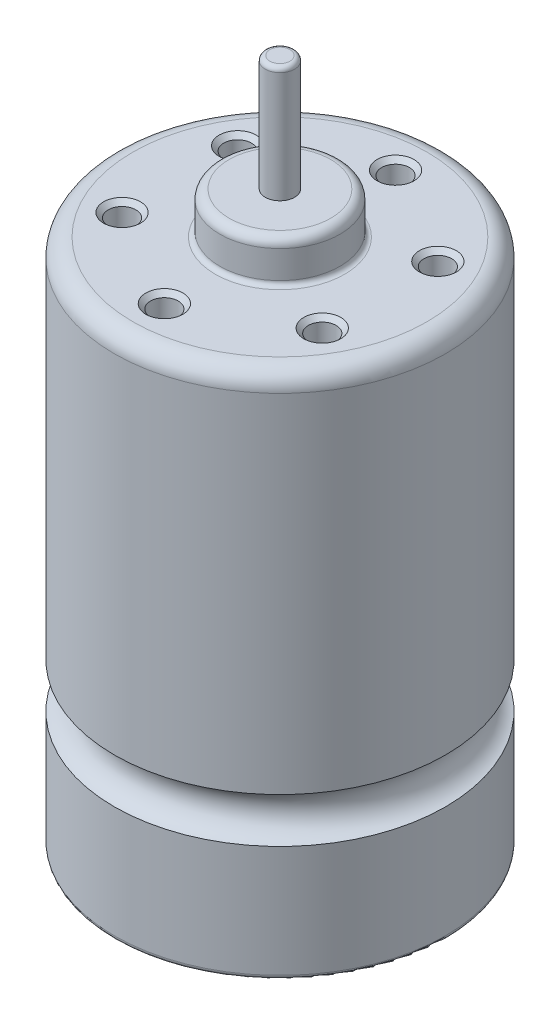
ISO-10303-21;
HEADER;
FILE_DESCRIPTION(('STEP AP214'),'2;1');
FILE_NAME('part.step','',(''),(''),'','','');
FILE_SCHEMA(('AUTOMOTIVE_DESIGN { 1 0 10303 214 1 1 1 1 }'));
ENDSEC;
DATA;
#1=APPLICATION_CONTEXT('core data for automotive mechanical design processes');
#2=APPLICATION_PROTOCOL_DEFINITION('international standard','automotive_design',2000,#1);
#3=PRODUCT_CONTEXT('',#1,'mechanical');
#4=PRODUCT('Part','Part','',(#3));
#5=PRODUCT_RELATED_PRODUCT_CATEGORY('part','',(#4));
#6=PRODUCT_DEFINITION_FORMATION('','',#4);
#7=PRODUCT_DEFINITION_CONTEXT('part definition',#1,'design');
#8=PRODUCT_DEFINITION('design','',#6,#7);
#9=PRODUCT_DEFINITION_SHAPE('','',#8);
#10=(LENGTH_UNIT() NAMED_UNIT(*) SI_UNIT(.MILLI.,.METRE.));
#11=(NAMED_UNIT(*) PLANE_ANGLE_UNIT() SI_UNIT($,.RADIAN.));
#12=(NAMED_UNIT(*) SI_UNIT($,.STERADIAN.) SOLID_ANGLE_UNIT());
#13=UNCERTAINTY_MEASURE_WITH_UNIT(LENGTH_MEASURE(1.E-05),#10,'distance_accuracy_value','');
#14=(GEOMETRIC_REPRESENTATION_CONTEXT(3) GLOBAL_UNCERTAINTY_ASSIGNED_CONTEXT((#13)) GLOBAL_UNIT_ASSIGNED_CONTEXT((#10,
#11,#12)) REPRESENTATION_CONTEXT('',''));
#15=CARTESIAN_POINT('',(0.,0.,0.));
#16=DIRECTION('',(0.,0.,1.));
#17=DIRECTION('',(1.,0.,0.));
#18=AXIS2_PLACEMENT_3D('',#15,#16,#17);
#19=CARTESIAN_POINT('',(0.,57.,0.));
#20=DIRECTION('',(0.,-1.,0.));
#21=DIRECTION('',(0.,0.,-1.));
#22=AXIS2_PLACEMENT_3D('',#19,#20,#21);
#23=CYLINDRICAL_SURFACE('',#22,17.9);
#24=CARTESIAN_POINT('',(0.,55.,0.));
#25=DIRECTION('',(0.,1.,0.));
#26=DIRECTION('',(0.,0.,1.));
#27=AXIS2_PLACEMENT_3D('',#24,#25,#26);
#28=CIRCLE('',#27,17.9);
#29=CARTESIAN_POINT('',(0.,55.,17.9));
#30=VERTEX_POINT('',#29);
#31=EDGE_CURVE('E67',#30,#30,#28,.F.);
#32=ORIENTED_EDGE('',*,*,#31,.T.);
#33=EDGE_LOOP('',(#32));
#34=FACE_BOUND('',#33,.T.);
#35=CARTESIAN_POINT('',(0.,17.4269322199023,0.));
#36=DIRECTION('',(0.,-1.,0.));
#37=DIRECTION('',(0.,0.,-1.));
#38=AXIS2_PLACEMENT_3D('',#35,#36,#37);
#39=CIRCLE('',#38,17.9);
#40=CARTESIAN_POINT('',(0.,17.4269322199023,-17.9));
#41=VERTEX_POINT('',#40);
#42=EDGE_CURVE('E122',#41,#41,#39,.F.);
#43=ORIENTED_EDGE('',*,*,#42,.T.);
#44=EDGE_LOOP('',(#43));
#45=FACE_BOUND('',#44,.T.);
#46=ADVANCED_FACE('F35',(#34,#45),#23,.T.);
#47=CARTESIAN_POINT('',(0.,57.,0.));
#48=DIRECTION('',(0.,1.,0.));
#49=DIRECTION('',(0.,0.,1.));
#50=AXIS2_PLACEMENT_3D('',#47,#48,#49);
#51=PLANE('',#50);
#52=CARTESIAN_POINT('',(0.,57.,0.));
#53=DIRECTION('',(0.,1.,0.));
#54=DIRECTION('',(0.,0.,1.));
#55=AXIS2_PLACEMENT_3D('',#52,#53,#54);
#56=CIRCLE('',#55,7.);
#57=CARTESIAN_POINT('',(0.,57.,7.));
#58=VERTEX_POINT('',#57);
#59=EDGE_CURVE('E42',#58,#58,#56,.F.);
#60=ORIENTED_EDGE('',*,*,#59,.T.);
#61=EDGE_LOOP('',(#60));
#62=FACE_BOUND('',#61,.T.);
#63=CARTESIAN_POINT('',(0.,57.,0.));
#64=DIRECTION('',(0.,1.,0.));
#65=DIRECTION('',(0.,0.,1.));
#66=AXIS2_PLACEMENT_3D('',#63,#64,#65);
#67=CIRCLE('',#66,15.9);
#68=CARTESIAN_POINT('',(0.,57.,15.9));
#69=VERTEX_POINT('',#68);
#70=EDGE_CURVE('E70',#69,#69,#67,.T.);
#71=ORIENTED_EDGE('',*,*,#70,.T.);
#72=EDGE_LOOP('',(#71));
#73=FACE_BOUND('',#72,.T.);
#74=CARTESIAN_POINT('',(10.8253175473055,57.,-6.25000000000001));
#75=DIRECTION('',(0.,1.,0.));
#76=DIRECTION('',(0.,0.,1.));
#77=AXIS2_PLACEMENT_3D('',#74,#75,#76);
#78=CIRCLE('',#77,1.99999999999999);
#79=CARTESIAN_POINT('',(10.8253175473055,57.,-4.25000000000002));
#80=VERTEX_POINT('',#79);
#81=EDGE_CURVE('E100',#80,#80,#78,.F.);
#82=ORIENTED_EDGE('',*,*,#81,.T.);
#83=EDGE_LOOP('',(#82));
#84=FACE_BOUND('',#83,.T.);
#85=CARTESIAN_POINT('',(10.8253175473055,57.,6.24999999999999));
#86=DIRECTION('',(0.,1.,0.));
#87=DIRECTION('',(0.,0.,1.));
#88=AXIS2_PLACEMENT_3D('',#85,#86,#87);
#89=CIRCLE('',#88,1.99999999999999);
#90=CARTESIAN_POINT('',(10.8253175473055,57.,8.24999999999998));
#91=VERTEX_POINT('',#90);
#92=EDGE_CURVE('E103',#91,#91,#89,.F.);
#93=ORIENTED_EDGE('',*,*,#92,.T.);
#94=EDGE_LOOP('',(#93));
#95=FACE_BOUND('',#94,.T.);
#96=CARTESIAN_POINT('',(0.,57.,12.5));
#97=DIRECTION('',(0.,1.,0.));
#98=DIRECTION('',(0.,0.,1.));
#99=AXIS2_PLACEMENT_3D('',#96,#97,#98);
#100=CIRCLE('',#99,1.99999999999999);
#101=CARTESIAN_POINT('',(0.,57.,14.5));
#102=VERTEX_POINT('',#101);
#103=EDGE_CURVE('E106',#102,#102,#100,.F.);
#104=ORIENTED_EDGE('',*,*,#103,.T.);
#105=EDGE_LOOP('',(#104));
#106=FACE_BOUND('',#105,.T.);
#107=CARTESIAN_POINT('',(-10.8253175473055,57.,6.25000000000001));
#108=DIRECTION('',(0.,1.,0.));
#109=DIRECTION('',(0.,0.,1.));
#110=AXIS2_PLACEMENT_3D('',#107,#108,#109);
#111=CIRCLE('',#110,1.99999999999997);
#112=CARTESIAN_POINT('',(-10.8253175473055,57.,8.24999999999998));
#113=VERTEX_POINT('',#112);
#114=EDGE_CURVE('E109',#113,#113,#111,.F.);
#115=ORIENTED_EDGE('',*,*,#114,.T.);
#116=EDGE_LOOP('',(#115));
#117=FACE_BOUND('',#116,.T.);
#118=CARTESIAN_POINT('',(-10.8253175473055,57.,-6.25));
#119=DIRECTION('',(0.,1.,0.));
#120=DIRECTION('',(0.,0.,1.));
#121=AXIS2_PLACEMENT_3D('',#118,#119,#120);
#122=CIRCLE('',#121,1.99999999999999);
#123=CARTESIAN_POINT('',(-10.8253175473055,57.,-4.25000000000001));
#124=VERTEX_POINT('',#123);
#125=EDGE_CURVE('E112',#124,#124,#122,.F.);
#126=ORIENTED_EDGE('',*,*,#125,.T.);
#127=EDGE_LOOP('',(#126));
#128=FACE_BOUND('',#127,.T.);
#129=CARTESIAN_POINT('',(0.,57.,-12.5));
#130=DIRECTION('',(0.,1.,0.));
#131=DIRECTION('',(0.,0.,1.));
#132=AXIS2_PLACEMENT_3D('',#129,#130,#131);
#133=CIRCLE('',#132,1.99999999999999);
#134=CARTESIAN_POINT('',(0.,57.,-10.5));
#135=VERTEX_POINT('',#134);
#136=EDGE_CURVE('E115',#135,#135,#133,.F.);
#137=ORIENTED_EDGE('',*,*,#136,.T.);
#138=EDGE_LOOP('',(#137));
#139=FACE_BOUND('',#138,.T.);
#140=ADVANCED_FACE('F172',(#62,#73,#84,#95,#106,#117,#128,#139),#51,.T.);
#141=CARTESIAN_POINT('',(0.,61.5,0.));
#142=DIRECTION('',(0.,-1.,0.));
#143=DIRECTION('',(0.,0.,-1.));
#144=AXIS2_PLACEMENT_3D('',#141,#142,#143);
#145=CYLINDRICAL_SURFACE('',#144,6.5);
#146=CARTESIAN_POINT('',(0.,57.5,0.));
#147=DIRECTION('',(0.,1.,0.));
#148=DIRECTION('',(0.,0.,1.));
#149=AXIS2_PLACEMENT_3D('',#146,#147,#148);
#150=CIRCLE('',#149,6.5);
#151=CARTESIAN_POINT('',(0.,57.5,6.5));
#152=VERTEX_POINT('',#151);
#153=EDGE_CURVE('E46',#152,#152,#150,.T.);
#154=ORIENTED_EDGE('',*,*,#153,.T.);
#155=EDGE_LOOP('',(#154));
#156=FACE_BOUND('',#155,.T.);
#157=CARTESIAN_POINT('',(0.,60.5,0.));
#158=DIRECTION('',(0.,1.,0.));
#159=DIRECTION('',(0.,0.,1.));
#160=AXIS2_PLACEMENT_3D('',#157,#158,#159);
#161=CIRCLE('',#160,6.5);
#162=CARTESIAN_POINT('',(0.,60.5,6.5));
#163=VERTEX_POINT('',#162);
#164=EDGE_CURVE('E73',#163,#163,#161,.F.);
#165=ORIENTED_EDGE('',*,*,#164,.T.);
#166=EDGE_LOOP('',(#165));
#167=FACE_BOUND('',#166,.T.);
#168=ADVANCED_FACE('F179',(#156,#167),#145,.T.);
#169=CARTESIAN_POINT('',(0.,61.5,0.));
#170=DIRECTION('',(0.,1.,0.));
#171=DIRECTION('',(0.,0.,1.));
#172=AXIS2_PLACEMENT_3D('',#169,#170,#171);
#173=PLANE('',#172);
#174=CARTESIAN_POINT('',(0.,61.5,0.));
#175=DIRECTION('',(0.,1.,0.));
#176=DIRECTION('',(0.,0.,1.));
#177=AXIS2_PLACEMENT_3D('',#174,#175,#176);
#178=CIRCLE('',#177,5.5);
#179=CARTESIAN_POINT('',(0.,61.5,5.5));
#180=VERTEX_POINT('',#179);
#181=EDGE_CURVE('E76',#180,#180,#178,.T.);
#182=ORIENTED_EDGE('',*,*,#181,.T.);
#183=EDGE_LOOP('',(#182));
#184=FACE_BOUND('',#183,.T.);
#185=CARTESIAN_POINT('',(0.,61.5,0.));
#186=DIRECTION('',(0.,1.,0.));
#187=DIRECTION('',(0.,0.,1.));
#188=AXIS2_PLACEMENT_3D('',#185,#186,#187);
#189=CIRCLE('',#188,1.585);
#190=CARTESIAN_POINT('',(0.,61.5,1.585));
#191=VERTEX_POINT('',#190);
#192=EDGE_CURVE('E125',#191,#191,#189,.F.);
#193=ORIENTED_EDGE('',*,*,#192,.T.);
#194=EDGE_LOOP('',(#193));
#195=FACE_BOUND('',#194,.T.);
#196=ADVANCED_FACE('F214',(#184,#195),#173,.T.);
#197=CARTESIAN_POINT('',(0.,74.,0.));
#198=DIRECTION('',(0.,-1.,0.));
#199=DIRECTION('',(0.,0.,-1.));
#200=AXIS2_PLACEMENT_3D('',#197,#198,#199);
#201=CYLINDRICAL_SURFACE('',#200,1.585);
#202=CARTESIAN_POINT('',(0.,73.5,0.));
#203=DIRECTION('',(0.,1.,0.));
#204=DIRECTION('',(0.,0.,1.));
#205=AXIS2_PLACEMENT_3D('',#202,#203,#204);
#206=CIRCLE('',#205,1.585);
#207=CARTESIAN_POINT('',(0.,73.5,1.585));
#208=VERTEX_POINT('',#207);
#209=EDGE_CURVE('E61',#208,#208,#206,.F.);
#210=ORIENTED_EDGE('',*,*,#209,.T.);
#211=EDGE_LOOP('',(#210));
#212=FACE_BOUND('',#211,.T.);
#213=ORIENTED_EDGE('',*,*,#192,.F.);
#214=EDGE_LOOP('',(#213));
#215=FACE_BOUND('',#214,.T.);
#216=ADVANCED_FACE('F207',(#212,#215),#201,.T.);
#217=CARTESIAN_POINT('',(0.,74.,0.));
#218=DIRECTION('',(0.,1.,0.));
#219=DIRECTION('',(0.,0.,1.));
#220=AXIS2_PLACEMENT_3D('',#217,#218,#219);
#221=PLANE('',#220);
#222=CARTESIAN_POINT('',(0.,74.,0.));
#223=DIRECTION('',(0.,1.,0.));
#224=DIRECTION('',(0.,0.,1.));
#225=AXIS2_PLACEMENT_3D('',#222,#223,#224);
#226=CIRCLE('',#225,1.085);
#227=CARTESIAN_POINT('',(0.,74.,1.085));
#228=VERTEX_POINT('',#227);
#229=EDGE_CURVE('E64',#228,#228,#226,.T.);
#230=ORIENTED_EDGE('',*,*,#229,.T.);
#231=EDGE_LOOP('',(#230));
#232=FACE_BOUND('',#231,.T.);
#233=ADVANCED_FACE('F201',(#232),#221,.T.);
#234=CARTESIAN_POINT('',(0.,15.,0.));
#235=DIRECTION('',(0.,1.,0.));
#236=DIRECTION('',(0.,0.,1.));
#237=AXIS2_PLACEMENT_3D('',#234,#235,#236);
#238=TOROIDAL_SURFACE('',#237,18.5,2.5);
#239=CARTESIAN_POINT('',(0.,12.5730677800977,0.));
#240=DIRECTION('',(0.,1.,0.));
#241=DIRECTION('',(0.,0.,1.));
#242=AXIS2_PLACEMENT_3D('',#239,#240,#241);
#243=CIRCLE('',#242,17.9);
#244=CARTESIAN_POINT('',(0.,12.5730677800977,17.9));
#245=VERTEX_POINT('',#244);
#246=EDGE_CURVE('E126',#245,#245,#243,.F.);
#247=ORIENTED_EDGE('',*,*,#246,.F.);
#248=EDGE_LOOP('',(#247));
#249=FACE_BOUND('',#248,.T.);
#250=ORIENTED_EDGE('',*,*,#42,.F.);
#251=EDGE_LOOP('',(#250));
#252=FACE_BOUND('',#251,.T.);
#253=ADVANCED_FACE('F194',(#249,#252),#238,.F.);
#254=CARTESIAN_POINT('',(0.,0.,0.));
#255=DIRECTION('',(0.,1.,0.));
#256=DIRECTION('',(0.,0.,1.));
#257=AXIS2_PLACEMENT_3D('',#254,#255,#256);
#258=PLANE('',#257);
#259=CARTESIAN_POINT('',(0.,0.,0.));
#260=DIRECTION('',(0.,1.,0.));
#261=DIRECTION('',(0.,0.,1.));
#262=AXIS2_PLACEMENT_3D('',#259,#260,#261);
#263=CIRCLE('',#262,5.6);
#264=CARTESIAN_POINT('',(0.,0.,5.6));
#265=VERTEX_POINT('',#264);
#266=EDGE_CURVE('E50',#265,#265,#263,.T.);
#267=ORIENTED_EDGE('',*,*,#266,.T.);
#268=EDGE_LOOP('',(#267));
#269=FACE_BOUND('',#268,.T.);
#270=CARTESIAN_POINT('',(0.,0.,0.));
#271=DIRECTION('',(0.,1.,0.));
#272=DIRECTION('',(0.,0.,1.));
#273=AXIS2_PLACEMENT_3D('',#270,#271,#272);
#274=CIRCLE('',#273,17.4);
#275=CARTESIAN_POINT('',(0.,0.,17.4));
#276=VERTEX_POINT('',#275);
#277=EDGE_CURVE('E55',#276,#276,#274,.F.);
#278=ORIENTED_EDGE('',*,*,#277,.T.);
#279=EDGE_LOOP('',(#278));
#280=FACE_BOUND('',#279,.T.);
#281=ADVANCED_FACE('F186',(#269,#280),#258,.F.);
#282=CARTESIAN_POINT('',(0.,0.5,0.));
#283=DIRECTION('',(0.,1.,0.));
#284=DIRECTION('',(0.,0.,1.));
#285=AXIS2_PLACEMENT_3D('',#282,#283,#284);
#286=CIRCLE('',#285,17.9);
#287=CARTESIAN_POINT('',(0.,0.5,17.9));
#288=VERTEX_POINT('',#287);
#289=EDGE_CURVE('E10',#288,#288,#286,.T.);
#290=ORIENTED_EDGE('',*,*,#289,.T.);
#291=EDGE_LOOP('',(#290));
#292=FACE_BOUND('',#291,.T.);
#293=ORIENTED_EDGE('',*,*,#246,.T.);
#294=EDGE_LOOP('',(#293));
#295=FACE_BOUND('',#294,.T.);
#296=ADVANCED_FACE('F175',(#292,#295),#23,.T.);
#297=CARTESIAN_POINT('',(0.,-3.,0.));
#298=DIRECTION('',(0.,1.,0.));
#299=DIRECTION('',(0.,0.,1.));
#300=AXIS2_PLACEMENT_3D('',#297,#298,#299);
#301=CYLINDRICAL_SURFACE('',#300,5.1);
#302=CARTESIAN_POINT('',(0.,-0.5,0.));
#303=DIRECTION('',(0.,1.,0.));
#304=DIRECTION('',(0.,0.,1.));
#305=AXIS2_PLACEMENT_3D('',#302,#303,#304);
#306=CIRCLE('',#305,5.1);
#307=CARTESIAN_POINT('',(0.,-0.5,5.1));
#308=VERTEX_POINT('',#307);
#309=EDGE_CURVE('E58',#308,#308,#306,.F.);
#310=ORIENTED_EDGE('',*,*,#309,.T.);
#311=EDGE_LOOP('',(#310));
#312=FACE_BOUND('',#311,.T.);
#313=CARTESIAN_POINT('',(0.,-2.,0.));
#314=DIRECTION('',(0.,-1.,0.));
#315=DIRECTION('',(0.,0.,-1.));
#316=AXIS2_PLACEMENT_3D('',#313,#314,#315);
#317=CIRCLE('',#316,5.1);
#318=CARTESIAN_POINT('',(0.,-2.,-5.1));
#319=VERTEX_POINT('',#318);
#320=EDGE_CURVE('E79',#319,#319,#317,.F.);
#321=ORIENTED_EDGE('',*,*,#320,.T.);
#322=EDGE_LOOP('',(#321));
#323=FACE_BOUND('',#322,.T.);
#324=ADVANCED_FACE('F185',(#312,#323),#301,.T.);
#325=CARTESIAN_POINT('',(0.,-3.,0.));
#326=DIRECTION('',(0.,-1.,0.));
#327=DIRECTION('',(0.,0.,-1.));
#328=AXIS2_PLACEMENT_3D('',#325,#326,#327);
#329=PLANE('',#328);
#330=CARTESIAN_POINT('',(0.,-3.,0.));
#331=DIRECTION('',(0.,-1.,0.));
#332=DIRECTION('',(0.,0.,-1.));
#333=AXIS2_PLACEMENT_3D('',#330,#331,#332);
#334=CIRCLE('',#333,4.1);
#335=CARTESIAN_POINT('',(0.,-3.,-4.1));
#336=VERTEX_POINT('',#335);
#337=EDGE_CURVE('E82',#336,#336,#334,.T.);
#338=ORIENTED_EDGE('',*,*,#337,.T.);
#339=EDGE_LOOP('',(#338));
#340=FACE_BOUND('',#339,.T.);
#341=CARTESIAN_POINT('',(0.,-3.,0.));
#342=DIRECTION('',(0.,-1.,0.));
#343=DIRECTION('',(0.,0.,-1.));
#344=AXIS2_PLACEMENT_3D('',#341,#342,#343);
#345=CIRCLE('',#344,1.585);
#346=CARTESIAN_POINT('',(0.,-3.,-1.585));
#347=VERTEX_POINT('',#346);
#348=EDGE_CURVE('E121',#347,#347,#345,.T.);
#349=ORIENTED_EDGE('',*,*,#348,.F.);
#350=EDGE_LOOP('',(#349));
#351=FACE_BOUND('',#350,.T.);
#352=ADVANCED_FACE('F191',(#340,#351),#329,.T.);
#353=CARTESIAN_POINT('',(0.,-4.,0.));
#354=DIRECTION('',(0.,1.,0.));
#355=DIRECTION('',(0.,0.,1.));
#356=AXIS2_PLACEMENT_3D('',#353,#354,#355);
#357=CYLINDRICAL_SURFACE('',#356,1.585);
#358=CARTESIAN_POINT('',(0.,-4.,0.));
#359=DIRECTION('',(0.,-1.,0.));
#360=DIRECTION('',(0.,0.,-1.));
#361=AXIS2_PLACEMENT_3D('',#358,#359,#360);
#362=CIRCLE('',#361,1.585);
#363=CARTESIAN_POINT('',(0.,-4.,-1.585));
#364=VERTEX_POINT('',#363);
#365=EDGE_CURVE('E129',#364,#364,#362,.T.);
#366=ORIENTED_EDGE('',*,*,#365,.F.);
#367=EDGE_LOOP('',(#366));
#368=FACE_BOUND('',#367,.T.);
#369=ORIENTED_EDGE('',*,*,#348,.T.);
#370=EDGE_LOOP('',(#369));
#371=FACE_BOUND('',#370,.T.);
#372=ADVANCED_FACE('F355',(#368,#371),#357,.T.);
#373=CARTESIAN_POINT('',(0.,-4.,0.));
#374=DIRECTION('',(0.,-1.,0.));
#375=DIRECTION('',(0.,0.,-1.));
#376=AXIS2_PLACEMENT_3D('',#373,#374,#375);
#377=PLANE('',#376);
#378=ORIENTED_EDGE('',*,*,#365,.T.);
#379=EDGE_LOOP('',(#378));
#380=FACE_BOUND('',#379,.T.);
#381=ADVANCED_FACE('F483',(#380),#377,.T.);
#382=CARTESIAN_POINT('',(-10.8253175473055,50.,6.25000000000001));
#383=DIRECTION('',(0.,1.,0.));
#384=DIRECTION('',(0.,0.,1.));
#385=AXIS2_PLACEMENT_3D('',#382,#383,#384);
#386=CYLINDRICAL_SURFACE('',#385,1.5);
#387=CARTESIAN_POINT('',(-10.8253175473055,56.5,6.25000000000001));
#388=DIRECTION('',(0.,1.,0.));
#389=DIRECTION('',(0.,0.,1.));
#390=AXIS2_PLACEMENT_3D('',#387,#388,#389);
#391=CIRCLE('',#390,1.5);
#392=CARTESIAN_POINT('',(-10.8253175473055,56.5,7.75));
#393=VERTEX_POINT('',#392);
#394=EDGE_CURVE('E91',#393,#393,#391,.T.);
#395=ORIENTED_EDGE('',*,*,#394,.T.);
#396=EDGE_LOOP('',(#395));
#397=FACE_BOUND('',#396,.T.);
#398=CARTESIAN_POINT('',(-10.8253175473055,50.,6.25000000000001));
#399=DIRECTION('',(0.,1.,0.));
#400=DIRECTION('',(0.,0.,1.));
#401=AXIS2_PLACEMENT_3D('',#398,#399,#400);
#402=CIRCLE('',#401,1.5);
#403=CARTESIAN_POINT('',(-10.8253175473055,50.,7.75));
#404=VERTEX_POINT('',#403);
#405=EDGE_CURVE('E147',#404,#404,#402,.T.);
#406=ORIENTED_EDGE('',*,*,#405,.F.);
#407=EDGE_LOOP('',(#406));
#408=FACE_BOUND('',#407,.T.);
#409=ADVANCED_FACE('F478',(#397,#408),#386,.F.);
#410=CARTESIAN_POINT('',(-10.8253175473055,50.,6.25000000000001));
#411=DIRECTION('',(0.,1.,0.));
#412=DIRECTION('',(0.,0.,1.));
#413=AXIS2_PLACEMENT_3D('',#410,#411,#412);
#414=PLANE('',#413);
#415=ORIENTED_EDGE('',*,*,#405,.T.);
#416=EDGE_LOOP('',(#415));
#417=FACE_BOUND('',#416,.T.);
#418=ADVANCED_FACE('F470',(#417),#414,.T.);
#419=CARTESIAN_POINT('',(-10.8253175473055,50.,-6.25));
#420=DIRECTION('',(0.,1.,0.));
#421=DIRECTION('',(0.,0.,1.));
#422=AXIS2_PLACEMENT_3D('',#419,#420,#421);
#423=CYLINDRICAL_SURFACE('',#422,1.5);
#424=CARTESIAN_POINT('',(-10.8253175473055,56.5,-6.25));
#425=DIRECTION('',(0.,1.,0.));
#426=DIRECTION('',(0.,0.,1.));
#427=AXIS2_PLACEMENT_3D('',#424,#425,#426);
#428=CIRCLE('',#427,1.5);
#429=CARTESIAN_POINT('',(-10.8253175473055,56.5,-4.75));
#430=VERTEX_POINT('',#429);
#431=EDGE_CURVE('E88',#430,#430,#428,.T.);
#432=ORIENTED_EDGE('',*,*,#431,.T.);
#433=EDGE_LOOP('',(#432));
#434=FACE_BOUND('',#433,.T.);
#435=CARTESIAN_POINT('',(-10.8253175473055,50.,-6.25));
#436=DIRECTION('',(0.,1.,0.));
#437=DIRECTION('',(0.,0.,1.));
#438=AXIS2_PLACEMENT_3D('',#435,#436,#437);
#439=CIRCLE('',#438,1.5);
#440=CARTESIAN_POINT('',(-10.8253175473055,50.,-4.75));
#441=VERTEX_POINT('',#440);
#442=EDGE_CURVE('E144',#441,#441,#439,.T.);
#443=ORIENTED_EDGE('',*,*,#442,.F.);
#444=EDGE_LOOP('',(#443));
#445=FACE_BOUND('',#444,.T.);
#446=ADVANCED_FACE('F465',(#434,#445),#423,.F.);
#447=CARTESIAN_POINT('',(-10.8253175473055,50.,-6.25));
#448=DIRECTION('',(0.,1.,0.));
#449=DIRECTION('',(0.,0.,1.));
#450=AXIS2_PLACEMENT_3D('',#447,#448,#449);
#451=PLANE('',#450);
#452=ORIENTED_EDGE('',*,*,#442,.T.);
#453=EDGE_LOOP('',(#452));
#454=FACE_BOUND('',#453,.T.);
#455=ADVANCED_FACE('F457',(#454),#451,.T.);
#456=CARTESIAN_POINT('',(0.,50.,-12.5));
#457=DIRECTION('',(0.,1.,0.));
#458=DIRECTION('',(0.,0.,1.));
#459=AXIS2_PLACEMENT_3D('',#456,#457,#458);
#460=CYLINDRICAL_SURFACE('',#459,1.5);
#461=CARTESIAN_POINT('',(0.,56.5,-12.5));
#462=DIRECTION('',(0.,1.,0.));
#463=DIRECTION('',(0.,0.,1.));
#464=AXIS2_PLACEMENT_3D('',#461,#462,#463);
#465=CIRCLE('',#464,1.5);
#466=CARTESIAN_POINT('',(0.,56.5,-11.));
#467=VERTEX_POINT('',#466);
#468=EDGE_CURVE('E85',#467,#467,#465,.T.);
#469=ORIENTED_EDGE('',*,*,#468,.T.);
#470=EDGE_LOOP('',(#469));
#471=FACE_BOUND('',#470,.T.);
#472=CARTESIAN_POINT('',(0.,50.,-12.5));
#473=DIRECTION('',(0.,1.,0.));
#474=DIRECTION('',(0.,0.,1.));
#475=AXIS2_PLACEMENT_3D('',#472,#473,#474);
#476=CIRCLE('',#475,1.5);
#477=CARTESIAN_POINT('',(0.,50.,-11.));
#478=VERTEX_POINT('',#477);
#479=EDGE_CURVE('E140',#478,#478,#476,.T.);
#480=ORIENTED_EDGE('',*,*,#479,.F.);
#481=EDGE_LOOP('',(#480));
#482=FACE_BOUND('',#481,.T.);
#483=ADVANCED_FACE('F452',(#471,#482),#460,.F.);
#484=CARTESIAN_POINT('',(0.,50.,-12.5));
#485=DIRECTION('',(0.,1.,0.));
#486=DIRECTION('',(0.,0.,1.));
#487=AXIS2_PLACEMENT_3D('',#484,#485,#486);
#488=PLANE('',#487);
#489=ORIENTED_EDGE('',*,*,#479,.T.);
#490=EDGE_LOOP('',(#489));
#491=FACE_BOUND('',#490,.T.);
#492=ADVANCED_FACE('F444',(#491),#488,.T.);
#493=CARTESIAN_POINT('',(10.8253175473055,50.,-6.25000000000001));
#494=DIRECTION('',(0.,1.,0.));
#495=DIRECTION('',(0.,0.,1.));
#496=AXIS2_PLACEMENT_3D('',#493,#494,#495);
#497=CYLINDRICAL_SURFACE('',#496,1.5);
#498=CARTESIAN_POINT('',(10.8253175473055,56.5,-6.25000000000001));
#499=DIRECTION('',(0.,1.,0.));
#500=DIRECTION('',(0.,0.,1.));
#501=AXIS2_PLACEMENT_3D('',#498,#499,#500);
#502=CIRCLE('',#501,1.5);
#503=CARTESIAN_POINT('',(10.8253175473055,56.5,-4.75000000000001));
#504=VERTEX_POINT('',#503);
#505=EDGE_CURVE('E118',#504,#504,#502,.T.);
#506=ORIENTED_EDGE('',*,*,#505,.T.);
#507=EDGE_LOOP('',(#506));
#508=FACE_BOUND('',#507,.T.);
#509=CARTESIAN_POINT('',(10.8253175473055,50.,-6.25000000000001));
#510=DIRECTION('',(0.,1.,0.));
#511=DIRECTION('',(0.,0.,1.));
#512=AXIS2_PLACEMENT_3D('',#509,#510,#511);
#513=CIRCLE('',#512,1.5);
#514=CARTESIAN_POINT('',(10.8253175473055,50.,-4.75000000000001));
#515=VERTEX_POINT('',#514);
#516=EDGE_CURVE('E137',#515,#515,#513,.T.);
#517=ORIENTED_EDGE('',*,*,#516,.F.);
#518=EDGE_LOOP('',(#517));
#519=FACE_BOUND('',#518,.T.);
#520=ADVANCED_FACE('F439',(#508,#519),#497,.F.);
#521=CARTESIAN_POINT('',(10.8253175473055,50.,-6.25000000000001));
#522=DIRECTION('',(0.,1.,0.));
#523=DIRECTION('',(0.,0.,1.));
#524=AXIS2_PLACEMENT_3D('',#521,#522,#523);
#525=PLANE('',#524);
#526=ORIENTED_EDGE('',*,*,#516,.T.);
#527=EDGE_LOOP('',(#526));
#528=FACE_BOUND('',#527,.T.);
#529=ADVANCED_FACE('F431',(#528),#525,.T.);
#530=CARTESIAN_POINT('',(10.8253175473055,50.,6.24999999999999));
#531=DIRECTION('',(0.,1.,0.));
#532=DIRECTION('',(0.,0.,1.));
#533=AXIS2_PLACEMENT_3D('',#530,#531,#532);
#534=CYLINDRICAL_SURFACE('',#533,1.5);
#535=CARTESIAN_POINT('',(10.8253175473055,56.5,6.24999999999999));
#536=DIRECTION('',(0.,1.,0.));
#537=DIRECTION('',(0.,0.,1.));
#538=AXIS2_PLACEMENT_3D('',#535,#536,#537);
#539=CIRCLE('',#538,1.5);
#540=CARTESIAN_POINT('',(10.8253175473055,56.5,7.74999999999999));
#541=VERTEX_POINT('',#540);
#542=EDGE_CURVE('E97',#541,#541,#539,.T.);
#543=ORIENTED_EDGE('',*,*,#542,.T.);
#544=EDGE_LOOP('',(#543));
#545=FACE_BOUND('',#544,.T.);
#546=CARTESIAN_POINT('',(10.8253175473055,50.,6.24999999999999));
#547=DIRECTION('',(0.,1.,0.));
#548=DIRECTION('',(0.,0.,1.));
#549=AXIS2_PLACEMENT_3D('',#546,#547,#548);
#550=CIRCLE('',#549,1.5);
#551=CARTESIAN_POINT('',(10.8253175473055,50.,7.74999999999999));
#552=VERTEX_POINT('',#551);
#553=EDGE_CURVE('E141',#552,#552,#550,.T.);
#554=ORIENTED_EDGE('',*,*,#553,.F.);
#555=EDGE_LOOP('',(#554));
#556=FACE_BOUND('',#555,.T.);
#557=ADVANCED_FACE('F168',(#545,#556),#534,.F.);
#558=CARTESIAN_POINT('',(10.8253175473055,50.,6.24999999999999));
#559=DIRECTION('',(0.,1.,0.));
#560=DIRECTION('',(0.,0.,1.));
#561=AXIS2_PLACEMENT_3D('',#558,#559,#560);
#562=PLANE('',#561);
#563=ORIENTED_EDGE('',*,*,#553,.T.);
#564=EDGE_LOOP('',(#563));
#565=FACE_BOUND('',#564,.T.);
#566=ADVANCED_FACE('F159',(#565),#562,.T.);
#567=CARTESIAN_POINT('',(0.,50.,12.5));
#568=DIRECTION('',(0.,1.,0.));
#569=DIRECTION('',(0.,0.,1.));
#570=AXIS2_PLACEMENT_3D('',#567,#568,#569);
#571=CYLINDRICAL_SURFACE('',#570,1.5);
#572=CARTESIAN_POINT('',(0.,56.5,12.5));
#573=DIRECTION('',(0.,1.,0.));
#574=DIRECTION('',(0.,0.,1.));
#575=AXIS2_PLACEMENT_3D('',#572,#573,#574);
#576=CIRCLE('',#575,1.5);
#577=CARTESIAN_POINT('',(0.,56.5,14.));
#578=VERTEX_POINT('',#577);
#579=EDGE_CURVE('E94',#578,#578,#576,.T.);
#580=ORIENTED_EDGE('',*,*,#579,.T.);
#581=EDGE_LOOP('',(#580));
#582=FACE_BOUND('',#581,.T.);
#583=CARTESIAN_POINT('',(0.,50.,12.5));
#584=DIRECTION('',(0.,1.,0.));
#585=DIRECTION('',(0.,0.,1.));
#586=AXIS2_PLACEMENT_3D('',#583,#584,#585);
#587=CIRCLE('',#586,1.5);
#588=CARTESIAN_POINT('',(0.,50.,14.));
#589=VERTEX_POINT('',#588);
#590=EDGE_CURVE('E136',#589,#589,#587,.T.);
#591=ORIENTED_EDGE('',*,*,#590,.F.);
#592=EDGE_LOOP('',(#591));
#593=FACE_BOUND('',#592,.T.);
#594=ADVANCED_FACE('F157',(#582,#593),#571,.F.);
#595=CARTESIAN_POINT('',(0.,50.,12.5));
#596=DIRECTION('',(0.,1.,0.));
#597=DIRECTION('',(0.,0.,1.));
#598=AXIS2_PLACEMENT_3D('',#595,#596,#597);
#599=PLANE('',#598);
#600=ORIENTED_EDGE('',*,*,#590,.T.);
#601=EDGE_LOOP('',(#600));
#602=FACE_BOUND('',#601,.T.);
#603=ADVANCED_FACE('F155',(#602),#599,.T.);
#604=CARTESIAN_POINT('',(10.8253175473055,56.5,-6.25000000000001));
#605=DIRECTION('',(0.,1.,0.));
#606=DIRECTION('',(0.,0.,1.));
#607=AXIS2_PLACEMENT_3D('',#604,#605,#606);
#608=CONICAL_SURFACE('',#607,1.5,0.785398163397442);
#609=ORIENTED_EDGE('',*,*,#81,.F.);
#610=EDGE_LOOP('',(#609));
#611=FACE_BOUND('',#610,.T.);
#612=ORIENTED_EDGE('',*,*,#505,.F.);
#613=EDGE_LOOP('',(#612));
#614=FACE_BOUND('',#613,.T.);
#615=ADVANCED_FACE('F166',(#611,#614),#608,.F.);
#616=CARTESIAN_POINT('',(10.8253175473055,56.5,6.24999999999999));
#617=DIRECTION('',(0.,1.,0.));
#618=DIRECTION('',(0.,0.,1.));
#619=AXIS2_PLACEMENT_3D('',#616,#617,#618);
#620=CONICAL_SURFACE('',#619,1.5,0.785398163397442);
#621=ORIENTED_EDGE('',*,*,#92,.F.);
#622=EDGE_LOOP('',(#621));
#623=FACE_BOUND('',#622,.T.);
#624=ORIENTED_EDGE('',*,*,#542,.F.);
#625=EDGE_LOOP('',(#624));
#626=FACE_BOUND('',#625,.T.);
#627=ADVANCED_FACE('F398',(#623,#626),#620,.F.);
#628=CARTESIAN_POINT('',(0.,56.5,12.5));
#629=DIRECTION('',(0.,1.,0.));
#630=DIRECTION('',(0.,0.,1.));
#631=AXIS2_PLACEMENT_3D('',#628,#629,#630);
#632=CONICAL_SURFACE('',#631,1.5,0.785398163397442);
#633=ORIENTED_EDGE('',*,*,#103,.F.);
#634=EDGE_LOOP('',(#633));
#635=FACE_BOUND('',#634,.T.);
#636=ORIENTED_EDGE('',*,*,#579,.F.);
#637=EDGE_LOOP('',(#636));
#638=FACE_BOUND('',#637,.T.);
#639=ADVANCED_FACE('F388',(#635,#638),#632,.F.);
#640=CARTESIAN_POINT('',(-10.8253175473055,56.5,6.25000000000001));
#641=DIRECTION('',(0.,1.,0.));
#642=DIRECTION('',(0.,0.,1.));
#643=AXIS2_PLACEMENT_3D('',#640,#641,#642);
#644=CONICAL_SURFACE('',#643,1.5,0.785398163397439);
#645=ORIENTED_EDGE('',*,*,#114,.F.);
#646=EDGE_LOOP('',(#645));
#647=FACE_BOUND('',#646,.T.);
#648=ORIENTED_EDGE('',*,*,#394,.F.);
#649=EDGE_LOOP('',(#648));
#650=FACE_BOUND('',#649,.T.);
#651=ADVANCED_FACE('F378',(#647,#650),#644,.F.);
#652=CARTESIAN_POINT('',(-10.8253175473055,56.5,-6.25));
#653=DIRECTION('',(0.,1.,0.));
#654=DIRECTION('',(0.,0.,1.));
#655=AXIS2_PLACEMENT_3D('',#652,#653,#654);
#656=CONICAL_SURFACE('',#655,1.5,0.785398163397439);
#657=ORIENTED_EDGE('',*,*,#125,.F.);
#658=EDGE_LOOP('',(#657));
#659=FACE_BOUND('',#658,.T.);
#660=ORIENTED_EDGE('',*,*,#431,.F.);
#661=EDGE_LOOP('',(#660));
#662=FACE_BOUND('',#661,.T.);
#663=ADVANCED_FACE('F369',(#659,#662),#656,.F.);
#664=CARTESIAN_POINT('',(0.,56.5,-12.5));
#665=DIRECTION('',(0.,1.,0.));
#666=DIRECTION('',(0.,0.,1.));
#667=AXIS2_PLACEMENT_3D('',#664,#665,#666);
#668=CONICAL_SURFACE('',#667,1.5,0.785398163397442);
#669=ORIENTED_EDGE('',*,*,#136,.F.);
#670=EDGE_LOOP('',(#669));
#671=FACE_BOUND('',#670,.T.);
#672=ORIENTED_EDGE('',*,*,#468,.F.);
#673=EDGE_LOOP('',(#672));
#674=FACE_BOUND('',#673,.T.);
#675=ADVANCED_FACE('F244',(#671,#674),#668,.F.);
#676=CARTESIAN_POINT('',(0.,-2.,0.));
#677=DIRECTION('',(0.,-1.,0.));
#678=DIRECTION('',(0.,0.,-1.));
#679=AXIS2_PLACEMENT_3D('',#676,#677,#678);
#680=TOROIDAL_SURFACE('',#679,4.1,1.);
#681=ORIENTED_EDGE('',*,*,#320,.F.);
#682=EDGE_LOOP('',(#681));
#683=FACE_BOUND('',#682,.T.);
#684=ORIENTED_EDGE('',*,*,#337,.F.);
#685=EDGE_LOOP('',(#684));
#686=FACE_BOUND('',#685,.T.);
#687=ADVANCED_FACE('F231',(#683,#686),#680,.T.);
#688=CARTESIAN_POINT('',(0.,60.5,0.));
#689=DIRECTION('',(0.,1.,0.));
#690=DIRECTION('',(0.,0.,1.));
#691=AXIS2_PLACEMENT_3D('',#688,#689,#690);
#692=TOROIDAL_SURFACE('',#691,5.5,1.);
#693=ORIENTED_EDGE('',*,*,#164,.F.);
#694=EDGE_LOOP('',(#693));
#695=FACE_BOUND('',#694,.T.);
#696=ORIENTED_EDGE('',*,*,#181,.F.);
#697=EDGE_LOOP('',(#696));
#698=FACE_BOUND('',#697,.T.);
#699=ADVANCED_FACE('F227',(#695,#698),#692,.T.);
#700=CARTESIAN_POINT('',(0.,55.,0.));
#701=DIRECTION('',(0.,1.,0.));
#702=DIRECTION('',(0.,0.,1.));
#703=AXIS2_PLACEMENT_3D('',#700,#701,#702);
#704=TOROIDAL_SURFACE('',#703,15.9,2.);
#705=ORIENTED_EDGE('',*,*,#31,.F.);
#706=EDGE_LOOP('',(#705));
#707=FACE_BOUND('',#706,.T.);
#708=ORIENTED_EDGE('',*,*,#70,.F.);
#709=EDGE_LOOP('',(#708));
#710=FACE_BOUND('',#709,.T.);
#711=ADVANCED_FACE('F230',(#707,#710),#704,.T.);
#712=CARTESIAN_POINT('',(0.,73.5,0.));
#713=DIRECTION('',(0.,1.,0.));
#714=DIRECTION('',(0.,0.,1.));
#715=AXIS2_PLACEMENT_3D('',#712,#713,#714);
#716=TOROIDAL_SURFACE('',#715,1.085,0.5);
#717=ORIENTED_EDGE('',*,*,#209,.F.);
#718=EDGE_LOOP('',(#717));
#719=FACE_BOUND('',#718,.T.);
#720=ORIENTED_EDGE('',*,*,#229,.F.);
#721=EDGE_LOOP('',(#720));
#722=FACE_BOUND('',#721,.T.);
#723=ADVANCED_FACE('F241',(#719,#722),#716,.T.);
#724=CARTESIAN_POINT('',(0.,-0.5,0.));
#725=DIRECTION('',(0.,1.,0.));
#726=DIRECTION('',(0.,0.,1.));
#727=AXIS2_PLACEMENT_3D('',#724,#725,#726);
#728=TOROIDAL_SURFACE('',#727,5.6,0.5);
#729=ORIENTED_EDGE('',*,*,#266,.F.);
#730=EDGE_LOOP('',(#729));
#731=FACE_BOUND('',#730,.T.);
#732=ORIENTED_EDGE('',*,*,#309,.F.);
#733=EDGE_LOOP('',(#732));
#734=FACE_BOUND('',#733,.T.);
#735=ADVANCED_FACE('F251',(#731,#734),#728,.F.);
#736=CARTESIAN_POINT('',(0.,57.5,0.));
#737=DIRECTION('',(0.,1.,0.));
#738=DIRECTION('',(0.,0.,1.));
#739=AXIS2_PLACEMENT_3D('',#736,#737,#738);
#740=TOROIDAL_SURFACE('',#739,7.,0.5);
#741=ORIENTED_EDGE('',*,*,#59,.F.);
#742=EDGE_LOOP('',(#741));
#743=FACE_BOUND('',#742,.T.);
#744=ORIENTED_EDGE('',*,*,#153,.F.);
#745=EDGE_LOOP('',(#744));
#746=FACE_BOUND('',#745,.T.);
#747=ADVANCED_FACE('F254',(#743,#746),#740,.F.);
#748=CARTESIAN_POINT('',(0.,0.5,0.));
#749=DIRECTION('',(0.,1.,0.));
#750=DIRECTION('',(0.,0.,1.));
#751=AXIS2_PLACEMENT_3D('',#748,#749,#750);
#752=TOROIDAL_SURFACE('',#751,17.4,0.5);
#753=ORIENTED_EDGE('',*,*,#277,.F.);
#754=EDGE_LOOP('',(#753));
#755=FACE_BOUND('',#754,.T.);
#756=ORIENTED_EDGE('',*,*,#289,.F.);
#757=EDGE_LOOP('',(#756));
#758=FACE_BOUND('',#757,.T.);
#759=ADVANCED_FACE('F37',(#755,#758),#752,.T.);
#760=CLOSED_SHELL('',(#46,#140,#168,#196,#216,#233,#253,#281,#296,#324,#352,#372,#381,#409,#418,
#446,#455,#483,#492,#520,#529,#557,#566,#594,#603,#615,#627,#639,#651,#663,#675,#687,#699,#711,
#723,#735,#747,#759));
#761=MANIFOLD_SOLID_BREP('B2',#760);
#762=ADVANCED_BREP_SHAPE_REPRESENTATION('',(#18,#761),#14);
#763=SHAPE_DEFINITION_REPRESENTATION(#9,#762);
ENDSEC;
END-ISO-10303-21;
